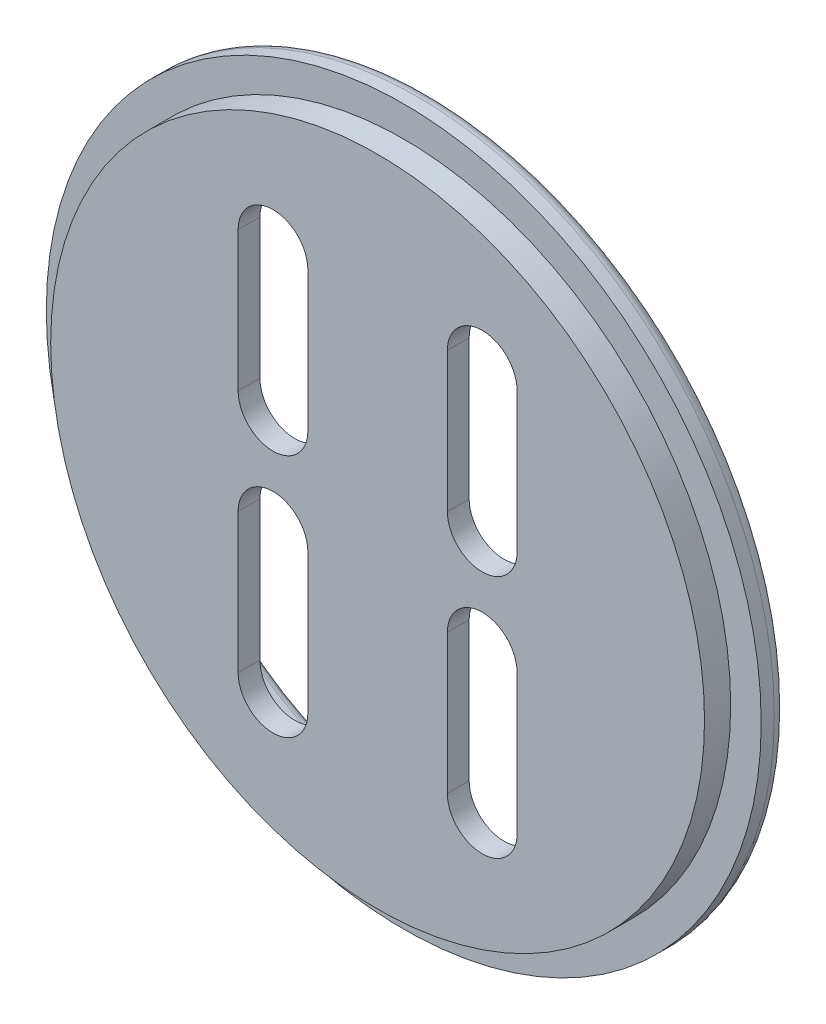
ISO-10303-21;
HEADER;
FILE_DESCRIPTION(('STEP AP214'),'2;1');
FILE_NAME('part.step','',(''),(''),'','','');
FILE_SCHEMA(('AUTOMOTIVE_DESIGN { 1 0 10303 214 1 1 1 1 }'));
ENDSEC;
DATA;
#1=APPLICATION_CONTEXT('core data for automotive mechanical design processes');
#2=APPLICATION_PROTOCOL_DEFINITION('international standard','automotive_design',2000,#1);
#3=PRODUCT_CONTEXT('',#1,'mechanical');
#4=PRODUCT('Part','Part','',(#3));
#5=PRODUCT_RELATED_PRODUCT_CATEGORY('part','',(#4));
#6=PRODUCT_DEFINITION_FORMATION('','',#4);
#7=PRODUCT_DEFINITION_CONTEXT('part definition',#1,'design');
#8=PRODUCT_DEFINITION('design','',#6,#7);
#9=PRODUCT_DEFINITION_SHAPE('','',#8);
#10=(LENGTH_UNIT() NAMED_UNIT(*) SI_UNIT(.MILLI.,.METRE.));
#11=(NAMED_UNIT(*) PLANE_ANGLE_UNIT() SI_UNIT($,.RADIAN.));
#12=(NAMED_UNIT(*) SI_UNIT($,.STERADIAN.) SOLID_ANGLE_UNIT());
#13=UNCERTAINTY_MEASURE_WITH_UNIT(LENGTH_MEASURE(1.E-05),#10,'distance_accuracy_value','');
#14=(GEOMETRIC_REPRESENTATION_CONTEXT(3) GLOBAL_UNCERTAINTY_ASSIGNED_CONTEXT((#13)) GLOBAL_UNIT_ASSIGNED_CONTEXT((#10,
#11,#12)) REPRESENTATION_CONTEXT('',''));
#15=CARTESIAN_POINT('',(0.,0.,0.));
#16=DIRECTION('',(0.,0.,1.));
#17=DIRECTION('',(1.,0.,0.));
#18=AXIS2_PLACEMENT_3D('',#15,#16,#17);
#19=CARTESIAN_POINT('',(0.,0.,3.));
#20=DIRECTION('',(0.,0.,-1.));
#21=DIRECTION('',(-1.,0.,0.));
#22=AXIS2_PLACEMENT_3D('',#19,#20,#21);
#23=CYLINDRICAL_SURFACE('',#22,41.);
#24=CARTESIAN_POINT('',(0.,0.,1.5));
#25=DIRECTION('',(0.,0.,1.));
#26=DIRECTION('',(1.,0.,0.));
#27=AXIS2_PLACEMENT_3D('',#24,#25,#26);
#28=CIRCLE('',#27,41.);
#29=CARTESIAN_POINT('',(41.,0.,1.5));
#30=VERTEX_POINT('',#29);
#31=EDGE_CURVE('E342',#30,#30,#28,.T.);
#32=ORIENTED_EDGE('',*,*,#31,.T.);
#33=EDGE_LOOP('',(#32));
#34=FACE_BOUND('',#33,.T.);
#35=CARTESIAN_POINT('',(0.,0.,3.));
#36=DIRECTION('',(0.,0.,1.));
#37=DIRECTION('',(1.,0.,0.));
#38=AXIS2_PLACEMENT_3D('',#35,#36,#37);
#39=CIRCLE('',#38,41.);
#40=CARTESIAN_POINT('',(41.,0.,3.));
#41=VERTEX_POINT('',#40);
#42=EDGE_CURVE('E326',#41,#41,#39,.T.);
#43=ORIENTED_EDGE('',*,*,#42,.F.);
#44=EDGE_LOOP('',(#43));
#45=FACE_BOUND('',#44,.T.);
#46=ADVANCED_FACE('F38',(#34,#45),#23,.T.);
#47=CARTESIAN_POINT('',(0.,0.,3.));
#48=DIRECTION('',(0.,0.,1.));
#49=DIRECTION('',(1.,0.,0.));
#50=AXIS2_PLACEMENT_3D('',#47,#48,#49);
#51=PLANE('',#50);
#52=CARTESIAN_POINT('',(0.,0.,3.));
#53=DIRECTION('',(0.,0.,1.));
#54=DIRECTION('',(1.,0.,0.));
#55=AXIS2_PLACEMENT_3D('',#52,#53,#54);
#56=CIRCLE('',#55,37.5);
#57=CARTESIAN_POINT('',(37.5,0.,3.));
#58=VERTEX_POINT('',#57);
#59=EDGE_CURVE('E327',#58,#58,#56,.T.);
#60=ORIENTED_EDGE('',*,*,#59,.F.);
#61=EDGE_LOOP('',(#60));
#62=FACE_BOUND('',#61,.T.);
#63=ORIENTED_EDGE('',*,*,#42,.T.);
#64=EDGE_LOOP('',(#63));
#65=FACE_BOUND('',#64,.T.);
#66=ADVANCED_FACE('F365',(#62,#65),#51,.T.);
#67=CARTESIAN_POINT('',(0.,0.,0.));
#68=DIRECTION('',(0.,0.,1.));
#69=DIRECTION('',(1.,0.,0.));
#70=AXIS2_PLACEMENT_3D('',#67,#68,#69);
#71=PLANE('',#70);
#72=CARTESIAN_POINT('',(0.,0.,0.));
#73=DIRECTION('',(0.,0.,1.));
#74=DIRECTION('',(1.,0.,0.));
#75=AXIS2_PLACEMENT_3D('',#72,#73,#74);
#76=CIRCLE('',#75,39.5);
#77=CARTESIAN_POINT('',(39.5,0.,0.));
#78=VERTEX_POINT('',#77);
#79=EDGE_CURVE('E346',#78,#78,#76,.F.);
#80=ORIENTED_EDGE('',*,*,#79,.T.);
#81=EDGE_LOOP('',(#80));
#82=FACE_BOUND('',#81,.T.);
#83=CARTESIAN_POINT('',(0.,0.,0.));
#84=DIRECTION('',(0.,0.,1.));
#85=DIRECTION('',(1.,0.,0.));
#86=AXIS2_PLACEMENT_3D('',#83,#84,#85);
#87=CIRCLE('',#86,32.5);
#88=CARTESIAN_POINT('',(32.5,0.,0.));
#89=VERTEX_POINT('',#88);
#90=EDGE_CURVE('E338',#89,#89,#87,.T.);
#91=ORIENTED_EDGE('',*,*,#90,.T.);
#92=EDGE_LOOP('',(#91));
#93=FACE_BOUND('',#92,.T.);
#94=ADVANCED_FACE('F371',(#82,#93),#71,.F.);
#95=CARTESIAN_POINT('',(0.,0.,6.));
#96=DIRECTION('',(0.,0.,-1.));
#97=DIRECTION('',(-1.,0.,0.));
#98=AXIS2_PLACEMENT_3D('',#95,#96,#97);
#99=CYLINDRICAL_SURFACE('',#98,37.5);
#100=CARTESIAN_POINT('',(0.,0.,6.));
#101=DIRECTION('',(0.,0.,1.));
#102=DIRECTION('',(1.,0.,0.));
#103=AXIS2_PLACEMENT_3D('',#100,#101,#102);
#104=CIRCLE('',#103,37.5);
#105=CARTESIAN_POINT('',(37.5,0.,6.));
#106=VERTEX_POINT('',#105);
#107=EDGE_CURVE('E322',#106,#106,#104,.T.);
#108=ORIENTED_EDGE('',*,*,#107,.F.);
#109=EDGE_LOOP('',(#108));
#110=FACE_BOUND('',#109,.T.);
#111=ORIENTED_EDGE('',*,*,#59,.T.);
#112=EDGE_LOOP('',(#111));
#113=FACE_BOUND('',#112,.T.);
#114=ADVANCED_FACE('F400',(#110,#113),#99,.T.);
#115=CARTESIAN_POINT('',(0.,0.,6.));
#116=DIRECTION('',(0.,0.,1.));
#117=DIRECTION('',(1.,0.,0.));
#118=AXIS2_PLACEMENT_3D('',#115,#116,#117);
#119=PLANE('',#118);
#120=CARTESIAN_POINT('',(12.,-6.,6.));
#121=DIRECTION('',(0.,0.,1.));
#122=DIRECTION('',(1.,0.,0.));
#123=AXIS2_PLACEMENT_3D('',#120,#121,#122);
#124=CIRCLE('',#123,4.);
#125=CARTESIAN_POINT('',(16.,-6.,6.));
#126=VERTEX_POINT('',#125);
#127=CARTESIAN_POINT('',(8.,-6.,6.));
#128=VERTEX_POINT('',#127);
#129=EDGE_CURVE('E319',#126,#128,#124,.T.);
#130=ORIENTED_EDGE('',*,*,#129,.F.);
#131=DIRECTION('',(0.,1.,0.));
#132=VECTOR('',#131,1.);
#133=CARTESIAN_POINT('',(16.,0.,6.));
#134=LINE('',#133,#132);
#135=CARTESIAN_POINT('',(16.,-22.,6.));
#136=VERTEX_POINT('',#135);
#137=EDGE_CURVE('E310',#136,#126,#134,.T.);
#138=ORIENTED_EDGE('',*,*,#137,.F.);
#139=CARTESIAN_POINT('',(12.,-22.,6.));
#140=DIRECTION('',(0.,0.,1.));
#141=DIRECTION('',(1.,0.,0.));
#142=AXIS2_PLACEMENT_3D('',#139,#140,#141);
#143=CIRCLE('',#142,4.);
#144=CARTESIAN_POINT('',(7.99999999999999,-22.,6.));
#145=VERTEX_POINT('',#144);
#146=EDGE_CURVE('E313',#145,#136,#143,.T.);
#147=ORIENTED_EDGE('',*,*,#146,.F.);
#148=DIRECTION('',(0.,-1.,0.));
#149=VECTOR('',#148,1.);
#150=CARTESIAN_POINT('',(8.,0.,6.));
#151=LINE('',#150,#149);
#152=EDGE_CURVE('E316',#128,#145,#151,.T.);
#153=ORIENTED_EDGE('',*,*,#152,.F.);
#154=EDGE_LOOP('',(#130,#138,#147,#153));
#155=FACE_BOUND('',#154,.T.);
#156=CARTESIAN_POINT('',(-12.,-5.99999999999999,6.));
#157=DIRECTION('',(0.,0.,1.));
#158=DIRECTION('',(1.,0.,0.));
#159=AXIS2_PLACEMENT_3D('',#156,#157,#158);
#160=CIRCLE('',#159,4.);
#161=CARTESIAN_POINT('',(-8.,-6.,6.));
#162=VERTEX_POINT('',#161);
#163=CARTESIAN_POINT('',(-16.,-5.99999999999999,6.));
#164=VERTEX_POINT('',#163);
#165=EDGE_CURVE('E307',#162,#164,#160,.T.);
#166=ORIENTED_EDGE('',*,*,#165,.F.);
#167=DIRECTION('',(0.,1.,0.));
#168=VECTOR('',#167,1.);
#169=CARTESIAN_POINT('',(-8.,0.,6.));
#170=LINE('',#169,#168);
#171=CARTESIAN_POINT('',(-8.00000000000001,-22.,6.));
#172=VERTEX_POINT('',#171);
#173=EDGE_CURVE('E298',#172,#162,#170,.T.);
#174=ORIENTED_EDGE('',*,*,#173,.F.);
#175=CARTESIAN_POINT('',(-12.,-22.,6.));
#176=DIRECTION('',(0.,0.,1.));
#177=DIRECTION('',(1.,0.,0.));
#178=AXIS2_PLACEMENT_3D('',#175,#176,#177);
#179=CIRCLE('',#178,4.);
#180=CARTESIAN_POINT('',(-16.,-22.,6.));
#181=VERTEX_POINT('',#180);
#182=EDGE_CURVE('E301',#181,#172,#179,.T.);
#183=ORIENTED_EDGE('',*,*,#182,.F.);
#184=DIRECTION('',(0.,-1.,0.));
#185=VECTOR('',#184,1.);
#186=CARTESIAN_POINT('',(-16.,0.,6.));
#187=LINE('',#186,#185);
#188=EDGE_CURVE('E304',#164,#181,#187,.T.);
#189=ORIENTED_EDGE('',*,*,#188,.F.);
#190=EDGE_LOOP('',(#166,#174,#183,#189));
#191=FACE_BOUND('',#190,.T.);
#192=CARTESIAN_POINT('',(-12.,6.,6.));
#193=DIRECTION('',(0.,0.,1.));
#194=DIRECTION('',(1.,0.,0.));
#195=AXIS2_PLACEMENT_3D('',#192,#193,#194);
#196=CIRCLE('',#195,4.);
#197=CARTESIAN_POINT('',(-16.,6.,6.));
#198=VERTEX_POINT('',#197);
#199=CARTESIAN_POINT('',(-8.,6.,6.));
#200=VERTEX_POINT('',#199);
#201=EDGE_CURVE('E295',#198,#200,#196,.T.);
#202=ORIENTED_EDGE('',*,*,#201,.F.);
#203=DIRECTION('',(0.,-1.,0.));
#204=VECTOR('',#203,1.);
#205=CARTESIAN_POINT('',(-16.,0.,6.));
#206=LINE('',#205,#204);
#207=CARTESIAN_POINT('',(-16.,22.,6.));
#208=VERTEX_POINT('',#207);
#209=EDGE_CURVE('E287',#208,#198,#206,.T.);
#210=ORIENTED_EDGE('',*,*,#209,.F.);
#211=CARTESIAN_POINT('',(-12.,22.,6.));
#212=DIRECTION('',(0.,0.,1.));
#213=DIRECTION('',(1.,0.,0.));
#214=AXIS2_PLACEMENT_3D('',#211,#212,#213);
#215=CIRCLE('',#214,4.);
#216=CARTESIAN_POINT('',(-8.,22.,6.));
#217=VERTEX_POINT('',#216);
#218=EDGE_CURVE('E160',#217,#208,#215,.T.);
#219=ORIENTED_EDGE('',*,*,#218,.F.);
#220=DIRECTION('',(0.,1.,0.));
#221=VECTOR('',#220,1.);
#222=CARTESIAN_POINT('',(-8.,0.,6.));
#223=LINE('',#222,#221);
#224=EDGE_CURVE('E292',#200,#217,#223,.T.);
#225=ORIENTED_EDGE('',*,*,#224,.F.);
#226=EDGE_LOOP('',(#202,#210,#219,#225));
#227=FACE_BOUND('',#226,.T.);
#228=CARTESIAN_POINT('',(12.,6.,6.));
#229=DIRECTION('',(0.,0.,1.));
#230=DIRECTION('',(1.,0.,0.));
#231=AXIS2_PLACEMENT_3D('',#228,#229,#230);
#232=CIRCLE('',#231,4.);
#233=CARTESIAN_POINT('',(8.,6.,6.));
#234=VERTEX_POINT('',#233);
#235=CARTESIAN_POINT('',(16.,6.,6.));
#236=VERTEX_POINT('',#235);
#237=EDGE_CURVE('E284',#234,#236,#232,.T.);
#238=ORIENTED_EDGE('',*,*,#237,.F.);
#239=DIRECTION('',(0.,-1.,0.));
#240=VECTOR('',#239,1.);
#241=CARTESIAN_POINT('',(8.,0.,6.));
#242=LINE('',#241,#240);
#243=CARTESIAN_POINT('',(8.,22.,6.));
#244=VERTEX_POINT('',#243);
#245=EDGE_CURVE('E265',#244,#234,#242,.T.);
#246=ORIENTED_EDGE('',*,*,#245,.F.);
#247=CARTESIAN_POINT('',(12.,22.,6.));
#248=DIRECTION('',(0.,0.,1.));
#249=DIRECTION('',(1.,0.,0.));
#250=AXIS2_PLACEMENT_3D('',#247,#248,#249);
#251=CIRCLE('',#250,4.);
#252=CARTESIAN_POINT('',(16.,22.,6.));
#253=VERTEX_POINT('',#252);
#254=EDGE_CURVE('E277',#253,#244,#251,.T.);
#255=ORIENTED_EDGE('',*,*,#254,.F.);
#256=DIRECTION('',(0.,1.,0.));
#257=VECTOR('',#256,1.);
#258=CARTESIAN_POINT('',(16.,0.,6.));
#259=LINE('',#258,#257);
#260=EDGE_CURVE('E281',#236,#253,#259,.T.);
#261=ORIENTED_EDGE('',*,*,#260,.F.);
#262=EDGE_LOOP('',(#238,#246,#255,#261));
#263=FACE_BOUND('',#262,.T.);
#264=ORIENTED_EDGE('',*,*,#107,.T.);
#265=EDGE_LOOP('',(#264));
#266=FACE_BOUND('',#265,.T.);
#267=ADVANCED_FACE('F391',(#155,#191,#227,#263,#266),#119,.T.);
#268=CARTESIAN_POINT('',(0.,0.,3.5));
#269=DIRECTION('',(0.,0.,-1.));
#270=DIRECTION('',(-1.,0.,0.));
#271=AXIS2_PLACEMENT_3D('',#268,#269,#270);
#272=CYLINDRICAL_SURFACE('',#271,31.5);
#273=CARTESIAN_POINT('',(0.,0.,2.5));
#274=DIRECTION('',(0.,0.,-1.));
#275=DIRECTION('',(-1.,0.,0.));
#276=AXIS2_PLACEMENT_3D('',#273,#274,#275);
#277=CIRCLE('',#276,31.5);
#278=CARTESIAN_POINT('',(-31.5,0.,2.5));
#279=VERTEX_POINT('',#278);
#280=EDGE_CURVE('E11',#279,#279,#277,.F.);
#281=ORIENTED_EDGE('',*,*,#280,.T.);
#282=EDGE_LOOP('',(#281));
#283=FACE_BOUND('',#282,.T.);
#284=CARTESIAN_POINT('',(0.,0.,1.));
#285=DIRECTION('',(0.,0.,1.));
#286=DIRECTION('',(1.,0.,0.));
#287=AXIS2_PLACEMENT_3D('',#284,#285,#286);
#288=CIRCLE('',#287,31.5);
#289=CARTESIAN_POINT('',(31.5,0.,1.));
#290=VERTEX_POINT('',#289);
#291=EDGE_CURVE('E331',#290,#290,#288,.F.);
#292=ORIENTED_EDGE('',*,*,#291,.T.);
#293=EDGE_LOOP('',(#292));
#294=FACE_BOUND('',#293,.T.);
#295=ADVANCED_FACE('F389',(#283,#294),#272,.F.);
#296=CARTESIAN_POINT('',(0.,0.,3.5));
#297=DIRECTION('',(0.,0.,-1.));
#298=DIRECTION('',(-1.,0.,0.));
#299=AXIS2_PLACEMENT_3D('',#296,#297,#298);
#300=PLANE('',#299);
#301=CARTESIAN_POINT('',(0.,0.,3.5));
#302=DIRECTION('',(0.,0.,-1.));
#303=DIRECTION('',(-1.,0.,0.));
#304=AXIS2_PLACEMENT_3D('',#301,#302,#303);
#305=CIRCLE('',#304,30.5);
#306=CARTESIAN_POINT('',(-30.5,0.,3.5));
#307=VERTEX_POINT('',#306);
#308=EDGE_CURVE('E47',#307,#307,#305,.T.);
#309=ORIENTED_EDGE('',*,*,#308,.T.);
#310=EDGE_LOOP('',(#309));
#311=FACE_BOUND('',#310,.T.);
#312=CARTESIAN_POINT('',(12.,-6.,3.5));
#313=DIRECTION('',(0.,0.,-1.));
#314=DIRECTION('',(1.,0.,0.));
#315=AXIS2_PLACEMENT_3D('',#312,#313,#314);
#316=CIRCLE('',#315,4.);
#317=CARTESIAN_POINT('',(8.,-6.,3.5));
#318=VERTEX_POINT('',#317);
#319=CARTESIAN_POINT('',(16.,-6.,3.5));
#320=VERTEX_POINT('',#319);
#321=EDGE_CURVE('E222',#318,#320,#316,.T.);
#322=ORIENTED_EDGE('',*,*,#321,.F.);
#323=DIRECTION('',(0.,1.,0.));
#324=VECTOR('',#323,1.);
#325=CARTESIAN_POINT('',(8.,-6.,3.5));
#326=LINE('',#325,#324);
#327=CARTESIAN_POINT('',(7.99999999999999,-22.,3.5));
#328=VERTEX_POINT('',#327);
#329=EDGE_CURVE('E232',#328,#318,#326,.T.);
#330=ORIENTED_EDGE('',*,*,#329,.F.);
#331=CARTESIAN_POINT('',(12.,-22.,3.5));
#332=DIRECTION('',(0.,0.,-1.));
#333=DIRECTION('',(1.,0.,0.));
#334=AXIS2_PLACEMENT_3D('',#331,#332,#333);
#335=CIRCLE('',#334,4.);
#336=CARTESIAN_POINT('',(16.,-22.,3.5));
#337=VERTEX_POINT('',#336);
#338=EDGE_CURVE('E228',#337,#328,#335,.T.);
#339=ORIENTED_EDGE('',*,*,#338,.F.);
#340=DIRECTION('',(0.,-1.,0.));
#341=VECTOR('',#340,1.);
#342=CARTESIAN_POINT('',(16.,-6.,3.5));
#343=LINE('',#342,#341);
#344=EDGE_CURVE('E225',#320,#337,#343,.T.);
#345=ORIENTED_EDGE('',*,*,#344,.F.);
#346=EDGE_LOOP('',(#322,#330,#339,#345));
#347=FACE_BOUND('',#346,.T.);
#348=CARTESIAN_POINT('',(-12.,-5.99999999999999,3.5));
#349=DIRECTION('',(0.,0.,-1.));
#350=DIRECTION('',(-1.,0.,0.));
#351=AXIS2_PLACEMENT_3D('',#348,#349,#350);
#352=CIRCLE('',#351,4.);
#353=CARTESIAN_POINT('',(-16.,-5.99999999999999,3.5));
#354=VERTEX_POINT('',#353);
#355=CARTESIAN_POINT('',(-8.,-6.,3.5));
#356=VERTEX_POINT('',#355);
#357=EDGE_CURVE('E195',#354,#356,#352,.T.);
#358=ORIENTED_EDGE('',*,*,#357,.F.);
#359=DIRECTION('',(0.,1.,0.));
#360=VECTOR('',#359,1.);
#361=CARTESIAN_POINT('',(-16.,-5.99999999999999,3.5));
#362=LINE('',#361,#360);
#363=CARTESIAN_POINT('',(-16.,-22.,3.5));
#364=VERTEX_POINT('',#363);
#365=EDGE_CURVE('E206',#364,#354,#362,.T.);
#366=ORIENTED_EDGE('',*,*,#365,.F.);
#367=CARTESIAN_POINT('',(-12.,-22.,3.5));
#368=DIRECTION('',(0.,0.,-1.));
#369=DIRECTION('',(-1.,0.,0.));
#370=AXIS2_PLACEMENT_3D('',#367,#368,#369);
#371=CIRCLE('',#370,4.);
#372=CARTESIAN_POINT('',(-8.00000000000001,-22.,3.5));
#373=VERTEX_POINT('',#372);
#374=EDGE_CURVE('E202',#373,#364,#371,.T.);
#375=ORIENTED_EDGE('',*,*,#374,.F.);
#376=DIRECTION('',(0.,-1.,0.));
#377=VECTOR('',#376,1.);
#378=CARTESIAN_POINT('',(-8.,-6.,3.5));
#379=LINE('',#378,#377);
#380=EDGE_CURVE('E198',#356,#373,#379,.T.);
#381=ORIENTED_EDGE('',*,*,#380,.F.);
#382=EDGE_LOOP('',(#358,#366,#375,#381));
#383=FACE_BOUND('',#382,.T.);
#384=CARTESIAN_POINT('',(-12.,6.,3.5));
#385=DIRECTION('',(0.,0.,-1.));
#386=DIRECTION('',(1.,0.,0.));
#387=AXIS2_PLACEMENT_3D('',#384,#385,#386);
#388=CIRCLE('',#387,4.);
#389=CARTESIAN_POINT('',(-8.,6.,3.5));
#390=VERTEX_POINT('',#389);
#391=CARTESIAN_POINT('',(-16.,6.,3.5));
#392=VERTEX_POINT('',#391);
#393=EDGE_CURVE('E175',#390,#392,#388,.T.);
#394=ORIENTED_EDGE('',*,*,#393,.F.);
#395=DIRECTION('',(0.,-1.,0.));
#396=VECTOR('',#395,1.);
#397=CARTESIAN_POINT('',(-8.,6.,3.5));
#398=LINE('',#397,#396);
#399=CARTESIAN_POINT('',(-8.,22.,3.5));
#400=VERTEX_POINT('',#399);
#401=EDGE_CURVE('E180',#400,#390,#398,.T.);
#402=ORIENTED_EDGE('',*,*,#401,.F.);
#403=CARTESIAN_POINT('',(-12.,22.,3.5));
#404=DIRECTION('',(0.,0.,-1.));
#405=DIRECTION('',(1.,0.,0.));
#406=AXIS2_PLACEMENT_3D('',#403,#404,#405);
#407=CIRCLE('',#406,4.);
#408=CARTESIAN_POINT('',(-16.,22.,3.5));
#409=VERTEX_POINT('',#408);
#410=EDGE_CURVE('E157',#409,#400,#407,.T.);
#411=ORIENTED_EDGE('',*,*,#410,.F.);
#412=DIRECTION('',(0.,1.,0.));
#413=VECTOR('',#412,1.);
#414=CARTESIAN_POINT('',(-16.,6.,3.5));
#415=LINE('',#414,#413);
#416=EDGE_CURVE('E169',#392,#409,#415,.T.);
#417=ORIENTED_EDGE('',*,*,#416,.F.);
#418=EDGE_LOOP('',(#394,#402,#411,#417));
#419=FACE_BOUND('',#418,.T.);
#420=CARTESIAN_POINT('',(12.,6.,3.5));
#421=DIRECTION('',(0.,0.,-1.));
#422=DIRECTION('',(-1.,0.,0.));
#423=AXIS2_PLACEMENT_3D('',#420,#421,#422);
#424=CIRCLE('',#423,4.);
#425=CARTESIAN_POINT('',(16.,6.,3.5));
#426=VERTEX_POINT('',#425);
#427=CARTESIAN_POINT('',(8.,6.,3.5));
#428=VERTEX_POINT('',#427);
#429=EDGE_CURVE('E190',#426,#428,#424,.T.);
#430=ORIENTED_EDGE('',*,*,#429,.F.);
#431=DIRECTION('',(0.,-1.,0.));
#432=VECTOR('',#431,1.);
#433=CARTESIAN_POINT('',(16.,6.,3.5));
#434=LINE('',#433,#432);
#435=CARTESIAN_POINT('',(16.,22.,3.5));
#436=VERTEX_POINT('',#435);
#437=EDGE_CURVE('E257',#436,#426,#434,.T.);
#438=ORIENTED_EDGE('',*,*,#437,.F.);
#439=CARTESIAN_POINT('',(12.,22.,3.5));
#440=DIRECTION('',(0.,0.,-1.));
#441=DIRECTION('',(-1.,0.,0.));
#442=AXIS2_PLACEMENT_3D('',#439,#440,#441);
#443=CIRCLE('',#442,4.);
#444=CARTESIAN_POINT('',(8.,22.,3.5));
#445=VERTEX_POINT('',#444);
#446=EDGE_CURVE('E253',#445,#436,#443,.T.);
#447=ORIENTED_EDGE('',*,*,#446,.F.);
#448=DIRECTION('',(0.,1.,0.));
#449=VECTOR('',#448,1.);
#450=CARTESIAN_POINT('',(8.,6.,3.5));
#451=LINE('',#450,#449);
#452=EDGE_CURVE('E249',#428,#445,#451,.T.);
#453=ORIENTED_EDGE('',*,*,#452,.F.);
#454=EDGE_LOOP('',(#430,#438,#447,#453));
#455=FACE_BOUND('',#454,.T.);
#456=ADVANCED_FACE('F177',(#311,#347,#383,#419,#455),#300,.T.);
#457=CARTESIAN_POINT('',(12.,6.,6.5));
#458=DIRECTION('',(0.,0.,-1.));
#459=DIRECTION('',(-1.,0.,0.));
#460=AXIS2_PLACEMENT_3D('',#457,#458,#459);
#461=CYLINDRICAL_SURFACE('',#460,4.);
#462=ORIENTED_EDGE('',*,*,#237,.T.);
#463=DIRECTION('',(0.,0.,-1.));
#464=VECTOR('',#463,1.);
#465=CARTESIAN_POINT('',(16.,6.,6.5));
#466=LINE('',#465,#464);
#467=EDGE_CURVE('E262',#236,#426,#466,.T.);
#468=ORIENTED_EDGE('',*,*,#467,.T.);
#469=ORIENTED_EDGE('',*,*,#429,.T.);
#470=DIRECTION('',(0.,0.,-1.));
#471=VECTOR('',#470,1.);
#472=CARTESIAN_POINT('',(8.,6.,6.5));
#473=LINE('',#472,#471);
#474=EDGE_CURVE('E261',#234,#428,#473,.T.);
#475=ORIENTED_EDGE('',*,*,#474,.F.);
#476=EDGE_LOOP('',(#462,#468,#469,#475));
#477=FACE_BOUND('',#476,.T.);
#478=ADVANCED_FACE('F398',(#477),#461,.F.);
#479=CARTESIAN_POINT('',(16.,6.,6.5));
#480=DIRECTION('',(1.,0.,0.));
#481=DIRECTION('',(0.,0.,-1.));
#482=AXIS2_PLACEMENT_3D('',#479,#480,#481);
#483=PLANE('',#482);
#484=ORIENTED_EDGE('',*,*,#260,.T.);
#485=DIRECTION('',(0.,0.,-1.));
#486=VECTOR('',#485,1.);
#487=CARTESIAN_POINT('',(16.,22.,6.5));
#488=LINE('',#487,#486);
#489=EDGE_CURVE('E266',#253,#436,#488,.T.);
#490=ORIENTED_EDGE('',*,*,#489,.T.);
#491=ORIENTED_EDGE('',*,*,#437,.T.);
#492=ORIENTED_EDGE('',*,*,#467,.F.);
#493=EDGE_LOOP('',(#484,#490,#491,#492));
#494=FACE_BOUND('',#493,.T.);
#495=ADVANCED_FACE('F449',(#494),#483,.F.);
#496=CARTESIAN_POINT('',(12.,22.,6.5));
#497=DIRECTION('',(0.,0.,-1.));
#498=DIRECTION('',(-1.,0.,0.));
#499=AXIS2_PLACEMENT_3D('',#496,#497,#498);
#500=CYLINDRICAL_SURFACE('',#499,4.);
#501=ORIENTED_EDGE('',*,*,#254,.T.);
#502=DIRECTION('',(0.,0.,-1.));
#503=VECTOR('',#502,1.);
#504=CARTESIAN_POINT('',(8.,22.,6.5));
#505=LINE('',#504,#503);
#506=EDGE_CURVE('E269',#244,#445,#505,.T.);
#507=ORIENTED_EDGE('',*,*,#506,.T.);
#508=ORIENTED_EDGE('',*,*,#446,.T.);
#509=ORIENTED_EDGE('',*,*,#489,.F.);
#510=EDGE_LOOP('',(#501,#507,#508,#509));
#511=FACE_BOUND('',#510,.T.);
#512=ADVANCED_FACE('F459',(#511),#500,.F.);
#513=CARTESIAN_POINT('',(8.,6.,6.5));
#514=DIRECTION('',(-1.,0.,0.));
#515=DIRECTION('',(0.,0.,1.));
#516=AXIS2_PLACEMENT_3D('',#513,#514,#515);
#517=PLANE('',#516);
#518=ORIENTED_EDGE('',*,*,#245,.T.);
#519=ORIENTED_EDGE('',*,*,#474,.T.);
#520=ORIENTED_EDGE('',*,*,#452,.T.);
#521=ORIENTED_EDGE('',*,*,#506,.F.);
#522=EDGE_LOOP('',(#518,#519,#520,#521));
#523=FACE_BOUND('',#522,.T.);
#524=ADVANCED_FACE('F469',(#523),#517,.F.);
#525=CARTESIAN_POINT('',(-12.,6.,6.5));
#526=DIRECTION('',(0.,0.,-1.));
#527=DIRECTION('',(-1.,0.,0.));
#528=AXIS2_PLACEMENT_3D('',#525,#526,#527);
#529=CYLINDRICAL_SURFACE('',#528,4.);
#530=ORIENTED_EDGE('',*,*,#201,.T.);
#531=DIRECTION('',(0.,0.,-1.));
#532=VECTOR('',#531,1.);
#533=CARTESIAN_POINT('',(-8.,6.,6.5));
#534=LINE('',#533,#532);
#535=EDGE_CURVE('E187',#200,#390,#534,.T.);
#536=ORIENTED_EDGE('',*,*,#535,.T.);
#537=ORIENTED_EDGE('',*,*,#393,.T.);
#538=DIRECTION('',(0.,0.,-1.));
#539=VECTOR('',#538,1.);
#540=CARTESIAN_POINT('',(-16.,6.,6.5));
#541=LINE('',#540,#539);
#542=EDGE_CURVE('E165',#198,#392,#541,.T.);
#543=ORIENTED_EDGE('',*,*,#542,.F.);
#544=EDGE_LOOP('',(#530,#536,#537,#543));
#545=FACE_BOUND('',#544,.T.);
#546=ADVANCED_FACE('F479',(#545),#529,.F.);
#547=CARTESIAN_POINT('',(-8.,6.,6.5));
#548=DIRECTION('',(1.,0.,0.));
#549=DIRECTION('',(0.,0.,-1.));
#550=AXIS2_PLACEMENT_3D('',#547,#548,#549);
#551=PLANE('',#550);
#552=ORIENTED_EDGE('',*,*,#224,.T.);
#553=DIRECTION('',(0.,0.,-1.));
#554=VECTOR('',#553,1.);
#555=CARTESIAN_POINT('',(-8.,22.,6.5));
#556=LINE('',#555,#554);
#557=EDGE_CURVE('E164',#217,#400,#556,.T.);
#558=ORIENTED_EDGE('',*,*,#557,.T.);
#559=ORIENTED_EDGE('',*,*,#401,.T.);
#560=ORIENTED_EDGE('',*,*,#535,.F.);
#561=EDGE_LOOP('',(#552,#558,#559,#560));
#562=FACE_BOUND('',#561,.T.);
#563=ADVANCED_FACE('F489',(#562),#551,.F.);
#564=CARTESIAN_POINT('',(-12.,22.,6.5));
#565=DIRECTION('',(0.,0.,-1.));
#566=DIRECTION('',(-1.,0.,0.));
#567=AXIS2_PLACEMENT_3D('',#564,#565,#566);
#568=CYLINDRICAL_SURFACE('',#567,4.);
#569=ORIENTED_EDGE('',*,*,#218,.T.);
#570=DIRECTION('',(0.,0.,-1.));
#571=VECTOR('',#570,1.);
#572=CARTESIAN_POINT('',(-16.,22.,6.5));
#573=LINE('',#572,#571);
#574=EDGE_CURVE('E152',#208,#409,#573,.T.);
#575=ORIENTED_EDGE('',*,*,#574,.T.);
#576=ORIENTED_EDGE('',*,*,#410,.T.);
#577=ORIENTED_EDGE('',*,*,#557,.F.);
#578=EDGE_LOOP('',(#569,#575,#576,#577));
#579=FACE_BOUND('',#578,.T.);
#580=ADVANCED_FACE('F154',(#579),#568,.F.);
#581=CARTESIAN_POINT('',(-16.,6.,6.5));
#582=DIRECTION('',(-1.,0.,0.));
#583=DIRECTION('',(0.,0.,1.));
#584=AXIS2_PLACEMENT_3D('',#581,#582,#583);
#585=PLANE('',#584);
#586=ORIENTED_EDGE('',*,*,#209,.T.);
#587=ORIENTED_EDGE('',*,*,#542,.T.);
#588=ORIENTED_EDGE('',*,*,#416,.T.);
#589=ORIENTED_EDGE('',*,*,#574,.F.);
#590=EDGE_LOOP('',(#586,#587,#588,#589));
#591=FACE_BOUND('',#590,.T.);
#592=ADVANCED_FACE('F170',(#591),#585,.F.);
#593=CARTESIAN_POINT('',(-12.,-5.99999999999999,6.5));
#594=DIRECTION('',(0.,0.,-1.));
#595=DIRECTION('',(-1.,0.,0.));
#596=AXIS2_PLACEMENT_3D('',#593,#594,#595);
#597=CYLINDRICAL_SURFACE('',#596,4.);
#598=ORIENTED_EDGE('',*,*,#165,.T.);
#599=DIRECTION('',(0.,0.,-1.));
#600=VECTOR('',#599,1.);
#601=CARTESIAN_POINT('',(-16.,-5.99999999999999,6.5));
#602=LINE('',#601,#600);
#603=EDGE_CURVE('E211',#164,#354,#602,.T.);
#604=ORIENTED_EDGE('',*,*,#603,.T.);
#605=ORIENTED_EDGE('',*,*,#357,.T.);
#606=DIRECTION('',(0.,0.,-1.));
#607=VECTOR('',#606,1.);
#608=CARTESIAN_POINT('',(-8.,-6.,6.5));
#609=LINE('',#608,#607);
#610=EDGE_CURVE('E210',#162,#356,#609,.T.);
#611=ORIENTED_EDGE('',*,*,#610,.F.);
#612=EDGE_LOOP('',(#598,#604,#605,#611));
#613=FACE_BOUND('',#612,.T.);
#614=ADVANCED_FACE('F516',(#613),#597,.F.);
#615=CARTESIAN_POINT('',(-16.,-5.99999999999999,6.5));
#616=DIRECTION('',(-1.,0.,0.));
#617=DIRECTION('',(0.,-1.,0.));
#618=AXIS2_PLACEMENT_3D('',#615,#616,#617);
#619=PLANE('',#618);
#620=ORIENTED_EDGE('',*,*,#188,.T.);
#621=DIRECTION('',(0.,0.,-1.));
#622=VECTOR('',#621,1.);
#623=CARTESIAN_POINT('',(-16.,-22.,6.5));
#624=LINE('',#623,#622);
#625=EDGE_CURVE('E214',#181,#364,#624,.T.);
#626=ORIENTED_EDGE('',*,*,#625,.T.);
#627=ORIENTED_EDGE('',*,*,#365,.T.);
#628=ORIENTED_EDGE('',*,*,#603,.F.);
#629=EDGE_LOOP('',(#620,#626,#627,#628));
#630=FACE_BOUND('',#629,.T.);
#631=ADVANCED_FACE('F525',(#630),#619,.F.);
#632=CARTESIAN_POINT('',(-12.,-22.,6.5));
#633=DIRECTION('',(0.,0.,-1.));
#634=DIRECTION('',(-1.,0.,0.));
#635=AXIS2_PLACEMENT_3D('',#632,#633,#634);
#636=CYLINDRICAL_SURFACE('',#635,4.);
#637=ORIENTED_EDGE('',*,*,#182,.T.);
#638=DIRECTION('',(0.,0.,-1.));
#639=VECTOR('',#638,1.);
#640=CARTESIAN_POINT('',(-8.00000000000001,-22.,6.5));
#641=LINE('',#640,#639);
#642=EDGE_CURVE('E62',#172,#373,#641,.T.);
#643=ORIENTED_EDGE('',*,*,#642,.T.);
#644=ORIENTED_EDGE('',*,*,#374,.T.);
#645=ORIENTED_EDGE('',*,*,#625,.F.);
#646=EDGE_LOOP('',(#637,#643,#644,#645));
#647=FACE_BOUND('',#646,.T.);
#648=ADVANCED_FACE('F535',(#647),#636,.F.);
#649=CARTESIAN_POINT('',(-8.,-6.,6.5));
#650=DIRECTION('',(1.,0.,0.));
#651=DIRECTION('',(0.,1.,0.));
#652=AXIS2_PLACEMENT_3D('',#649,#650,#651);
#653=PLANE('',#652);
#654=ORIENTED_EDGE('',*,*,#173,.T.);
#655=ORIENTED_EDGE('',*,*,#610,.T.);
#656=ORIENTED_EDGE('',*,*,#380,.T.);
#657=ORIENTED_EDGE('',*,*,#642,.F.);
#658=EDGE_LOOP('',(#654,#655,#656,#657));
#659=FACE_BOUND('',#658,.T.);
#660=ADVANCED_FACE('F545',(#659),#653,.F.);
#661=CARTESIAN_POINT('',(12.,-6.,6.5));
#662=DIRECTION('',(0.,0.,-1.));
#663=DIRECTION('',(-1.,0.,0.));
#664=AXIS2_PLACEMENT_3D('',#661,#662,#663);
#665=CYLINDRICAL_SURFACE('',#664,4.);
#666=ORIENTED_EDGE('',*,*,#129,.T.);
#667=DIRECTION('',(0.,0.,-1.));
#668=VECTOR('',#667,1.);
#669=CARTESIAN_POINT('',(8.,-6.,6.5));
#670=LINE('',#669,#668);
#671=EDGE_CURVE('E199',#128,#318,#670,.T.);
#672=ORIENTED_EDGE('',*,*,#671,.T.);
#673=ORIENTED_EDGE('',*,*,#321,.T.);
#674=DIRECTION('',(0.,0.,-1.));
#675=VECTOR('',#674,1.);
#676=CARTESIAN_POINT('',(16.,-6.,6.5));
#677=LINE('',#676,#675);
#678=EDGE_CURVE('E236',#126,#320,#677,.T.);
#679=ORIENTED_EDGE('',*,*,#678,.F.);
#680=EDGE_LOOP('',(#666,#672,#673,#679));
#681=FACE_BOUND('',#680,.T.);
#682=ADVANCED_FACE('F555',(#681),#665,.F.);
#683=CARTESIAN_POINT('',(8.,-6.,6.5));
#684=DIRECTION('',(-1.,0.,0.));
#685=DIRECTION('',(0.,-1.,0.));
#686=AXIS2_PLACEMENT_3D('',#683,#684,#685);
#687=PLANE('',#686);
#688=ORIENTED_EDGE('',*,*,#152,.T.);
#689=DIRECTION('',(0.,0.,-1.));
#690=VECTOR('',#689,1.);
#691=CARTESIAN_POINT('',(7.99999999999999,-22.,6.5));
#692=LINE('',#691,#690);
#693=EDGE_CURVE('E239',#145,#328,#692,.T.);
#694=ORIENTED_EDGE('',*,*,#693,.T.);
#695=ORIENTED_EDGE('',*,*,#329,.T.);
#696=ORIENTED_EDGE('',*,*,#671,.F.);
#697=EDGE_LOOP('',(#688,#694,#695,#696));
#698=FACE_BOUND('',#697,.T.);
#699=ADVANCED_FACE('F564',(#698),#687,.F.);
#700=CARTESIAN_POINT('',(12.,-22.,6.5));
#701=DIRECTION('',(0.,0.,-1.));
#702=DIRECTION('',(-1.,0.,0.));
#703=AXIS2_PLACEMENT_3D('',#700,#701,#702);
#704=CYLINDRICAL_SURFACE('',#703,4.);
#705=ORIENTED_EDGE('',*,*,#146,.T.);
#706=DIRECTION('',(0.,0.,-1.));
#707=VECTOR('',#706,1.);
#708=CARTESIAN_POINT('',(16.,-22.,6.5));
#709=LINE('',#708,#707);
#710=EDGE_CURVE('E54',#136,#337,#709,.T.);
#711=ORIENTED_EDGE('',*,*,#710,.T.);
#712=ORIENTED_EDGE('',*,*,#338,.T.);
#713=ORIENTED_EDGE('',*,*,#693,.F.);
#714=EDGE_LOOP('',(#705,#711,#712,#713));
#715=FACE_BOUND('',#714,.T.);
#716=ADVANCED_FACE('F383',(#715),#704,.F.);
#717=CARTESIAN_POINT('',(16.,-6.,6.5));
#718=DIRECTION('',(1.,0.,0.));
#719=DIRECTION('',(0.,1.,0.));
#720=AXIS2_PLACEMENT_3D('',#717,#718,#719);
#721=PLANE('',#720);
#722=ORIENTED_EDGE('',*,*,#137,.T.);
#723=ORIENTED_EDGE('',*,*,#678,.T.);
#724=ORIENTED_EDGE('',*,*,#344,.T.);
#725=ORIENTED_EDGE('',*,*,#710,.F.);
#726=EDGE_LOOP('',(#722,#723,#724,#725));
#727=FACE_BOUND('',#726,.T.);
#728=ADVANCED_FACE('F378',(#727),#721,.F.);
#729=CARTESIAN_POINT('',(0.,0.,1.));
#730=DIRECTION('',(0.,0.,1.));
#731=DIRECTION('',(1.,0.,0.));
#732=AXIS2_PLACEMENT_3D('',#729,#730,#731);
#733=TOROIDAL_SURFACE('',#732,32.5,1.);
#734=ORIENTED_EDGE('',*,*,#90,.F.);
#735=EDGE_LOOP('',(#734));
#736=FACE_BOUND('',#735,.T.);
#737=ORIENTED_EDGE('',*,*,#291,.F.);
#738=EDGE_LOOP('',(#737));
#739=FACE_BOUND('',#738,.T.);
#740=ADVANCED_FACE('F361',(#736,#739),#733,.T.);
#741=CARTESIAN_POINT('',(0.,0.,1.5));
#742=DIRECTION('',(0.,0.,1.));
#743=DIRECTION('',(1.,0.,0.));
#744=AXIS2_PLACEMENT_3D('',#741,#742,#743);
#745=TOROIDAL_SURFACE('',#744,39.5,1.5);
#746=ORIENTED_EDGE('',*,*,#79,.F.);
#747=EDGE_LOOP('',(#746));
#748=FACE_BOUND('',#747,.T.);
#749=ORIENTED_EDGE('',*,*,#31,.F.);
#750=EDGE_LOOP('',(#749));
#751=FACE_BOUND('',#750,.T.);
#752=ADVANCED_FACE('F356',(#748,#751),#745,.T.);
#753=CARTESIAN_POINT('',(0.,0.,2.5));
#754=DIRECTION('',(0.,0.,-1.));
#755=DIRECTION('',(-1.,0.,0.));
#756=AXIS2_PLACEMENT_3D('',#753,#754,#755);
#757=TOROIDAL_SURFACE('',#756,30.5,1.);
#758=ORIENTED_EDGE('',*,*,#280,.F.);
#759=EDGE_LOOP('',(#758));
#760=FACE_BOUND('',#759,.T.);
#761=ORIENTED_EDGE('',*,*,#308,.F.);
#762=EDGE_LOOP('',(#761));
#763=FACE_BOUND('',#762,.T.);
#764=ADVANCED_FACE('F40',(#760,#763),#757,.F.);
#765=CLOSED_SHELL('',(#46,#66,#94,#114,#267,#295,#456,#478,#495,#512,#524,#546,#563,#580,#592,
#614,#631,#648,#660,#682,#699,#716,#728,#740,#752,#764));
#766=MANIFOLD_SOLID_BREP('B2',#765);
#767=ADVANCED_BREP_SHAPE_REPRESENTATION('',(#18,#766),#14);
#768=SHAPE_DEFINITION_REPRESENTATION(#9,#767);
ENDSEC;
END-ISO-10303-21;
